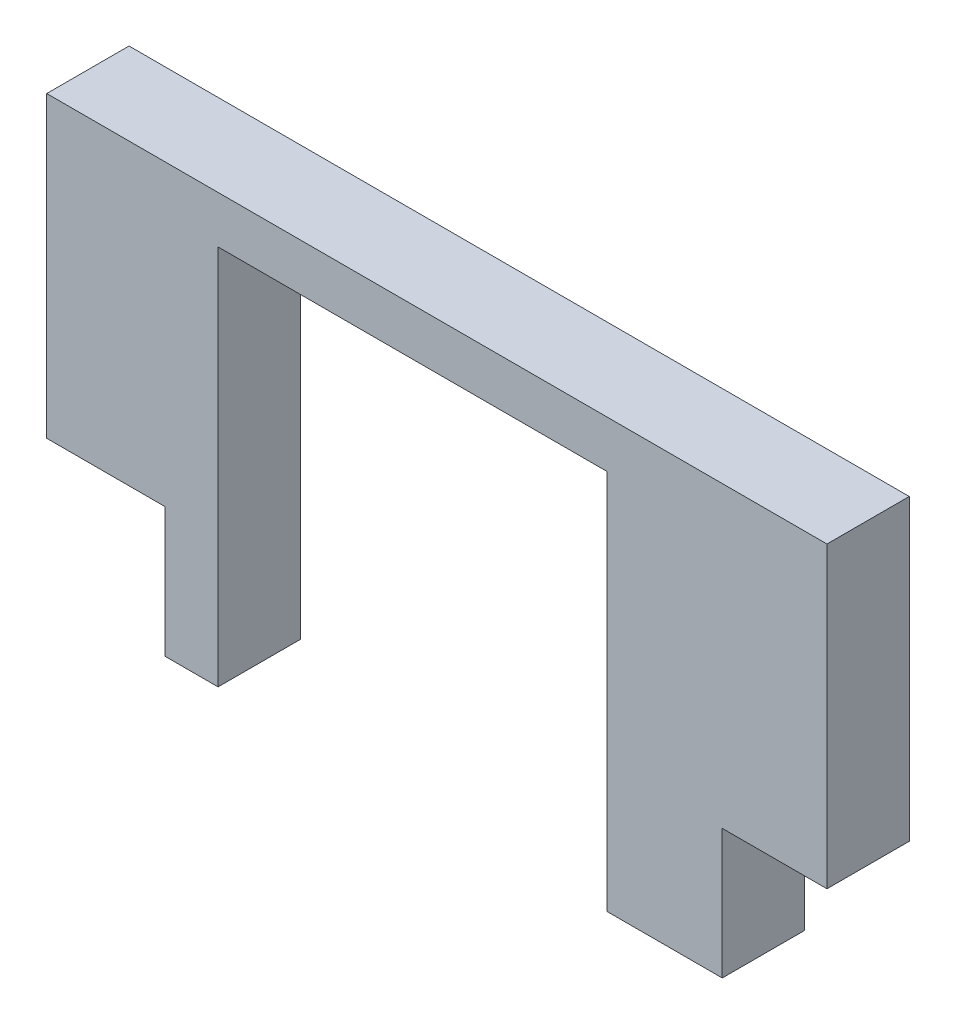
ISO-10303-21;
HEADER;
FILE_DESCRIPTION(('STEP AP214'),'2;1');
FILE_NAME('part.step','',(''),(''),'','','');
FILE_SCHEMA(('AUTOMOTIVE_DESIGN { 1 0 10303 214 1 1 1 1 }'));
ENDSEC;
DATA;
#1=APPLICATION_CONTEXT('core data for automotive mechanical design processes');
#2=APPLICATION_PROTOCOL_DEFINITION('international standard','automotive_design',2000,#1);
#3=PRODUCT_CONTEXT('',#1,'mechanical');
#4=PRODUCT('Part','Part','',(#3));
#5=PRODUCT_RELATED_PRODUCT_CATEGORY('part','',(#4));
#6=PRODUCT_DEFINITION_FORMATION('','',#4);
#7=PRODUCT_DEFINITION_CONTEXT('part definition',#1,'design');
#8=PRODUCT_DEFINITION('design','',#6,#7);
#9=PRODUCT_DEFINITION_SHAPE('','',#8);
#10=(LENGTH_UNIT() NAMED_UNIT(*) SI_UNIT(.MILLI.,.METRE.));
#11=(NAMED_UNIT(*) PLANE_ANGLE_UNIT() SI_UNIT($,.RADIAN.));
#12=(NAMED_UNIT(*) SI_UNIT($,.STERADIAN.) SOLID_ANGLE_UNIT());
#13=UNCERTAINTY_MEASURE_WITH_UNIT(LENGTH_MEASURE(1.E-05),#10,'distance_accuracy_value','');
#14=(GEOMETRIC_REPRESENTATION_CONTEXT(3) GLOBAL_UNCERTAINTY_ASSIGNED_CONTEXT((#13)) GLOBAL_UNIT_ASSIGNED_CONTEXT((#10,
#11,#12)) REPRESENTATION_CONTEXT('',''));
#15=CARTESIAN_POINT('',(0.,0.,0.));
#16=DIRECTION('',(0.,0.,1.));
#17=DIRECTION('',(1.,0.,0.));
#18=AXIS2_PLACEMENT_3D('',#15,#16,#17);
#19=CARTESIAN_POINT('',(0.,16.66,-3.175));
#20=DIRECTION('',(0.,1.,0.));
#21=DIRECTION('',(0.,0.,1.));
#22=AXIS2_PLACEMENT_3D('',#19,#20,#21);
#23=PLANE('',#22);
#24=DIRECTION('',(-1.,0.,0.));
#25=VECTOR('',#24,1.);
#26=CARTESIAN_POINT('',(0.,16.66,0.));
#27=LINE('',#26,#25);
#28=CARTESIAN_POINT('',(30.1,16.66,0.));
#29=VERTEX_POINT('',#28);
#30=CARTESIAN_POINT('',(0.,16.66,0.));
#31=VERTEX_POINT('',#30);
#32=EDGE_CURVE('E188',#29,#31,#27,.T.);
#33=ORIENTED_EDGE('',*,*,#32,.F.);
#34=DIRECTION('',(0.,0.,1.));
#35=VECTOR('',#34,1.);
#36=CARTESIAN_POINT('',(30.1,16.66,-3.175));
#37=LINE('',#36,#35);
#38=CARTESIAN_POINT('',(30.1,16.66,-3.175));
#39=VERTEX_POINT('',#38);
#40=EDGE_CURVE('E51',#39,#29,#37,.T.);
#41=ORIENTED_EDGE('',*,*,#40,.F.);
#42=DIRECTION('',(-1.,0.,0.));
#43=VECTOR('',#42,1.);
#44=CARTESIAN_POINT('',(0.,16.66,-3.175));
#45=LINE('',#44,#43);
#46=CARTESIAN_POINT('',(0.,16.66,-3.175));
#47=VERTEX_POINT('',#46);
#48=EDGE_CURVE('E150',#39,#47,#45,.T.);
#49=ORIENTED_EDGE('',*,*,#48,.T.);
#50=DIRECTION('',(0.,0.,1.));
#51=VECTOR('',#50,1.);
#52=CARTESIAN_POINT('',(0.,16.66,-3.175));
#53=LINE('',#52,#51);
#54=EDGE_CURVE('E11',#47,#31,#53,.T.);
#55=ORIENTED_EDGE('',*,*,#54,.T.);
#56=EDGE_LOOP('',(#33,#41,#49,#55));
#57=FACE_BOUND('',#56,.T.);
#58=ADVANCED_FACE('F41',(#57),#23,.T.);
#59=CARTESIAN_POINT('',(30.1,16.66,-3.175));
#60=DIRECTION('',(1.,0.,0.));
#61=DIRECTION('',(0.,0.,-1.));
#62=AXIS2_PLACEMENT_3D('',#59,#60,#61);
#63=PLANE('',#62);
#64=DIRECTION('',(0.,1.,0.));
#65=VECTOR('',#64,1.);
#66=CARTESIAN_POINT('',(30.1,16.66,0.));
#67=LINE('',#66,#65);
#68=CARTESIAN_POINT('',(30.1,5.13999999999969,0.));
#69=VERTEX_POINT('',#68);
#70=EDGE_CURVE('E135',#69,#29,#67,.T.);
#71=ORIENTED_EDGE('',*,*,#70,.F.);
#72=DIRECTION('',(0.,0.,1.));
#73=VECTOR('',#72,1.);
#74=CARTESIAN_POINT('',(30.1,5.13999999999969,-3.175));
#75=LINE('',#74,#73);
#76=CARTESIAN_POINT('',(30.1,5.13999999999969,-3.175));
#77=VERTEX_POINT('',#76);
#78=EDGE_CURVE('E131',#77,#69,#75,.T.);
#79=ORIENTED_EDGE('',*,*,#78,.F.);
#80=DIRECTION('',(0.,1.,0.));
#81=VECTOR('',#80,1.);
#82=CARTESIAN_POINT('',(30.1,6.34,-3.175));
#83=LINE('',#82,#81);
#84=EDGE_CURVE('E134',#77,#39,#83,.T.);
#85=ORIENTED_EDGE('',*,*,#84,.T.);
#86=ORIENTED_EDGE('',*,*,#40,.T.);
#87=EDGE_LOOP('',(#71,#79,#85,#86));
#88=FACE_BOUND('',#87,.T.);
#89=ADVANCED_FACE('F133',(#88),#63,.T.);
#90=CARTESIAN_POINT('',(30.1,5.13999999999969,-3.175));
#91=DIRECTION('',(0.,-1.,0.));
#92=DIRECTION('',(1.,0.,0.));
#93=AXIS2_PLACEMENT_3D('',#90,#91,#92);
#94=PLANE('',#93);
#95=DIRECTION('',(1.,0.,0.));
#96=VECTOR('',#95,1.);
#97=CARTESIAN_POINT('',(30.1,5.13999999999969,0.));
#98=LINE('',#97,#96);
#99=CARTESIAN_POINT('',(26.0600000000024,5.1399999999997,0.));
#100=VERTEX_POINT('',#99);
#101=EDGE_CURVE('E185',#100,#69,#98,.T.);
#102=ORIENTED_EDGE('',*,*,#101,.F.);
#103=DIRECTION('',(0.,0.,1.));
#104=VECTOR('',#103,1.);
#105=CARTESIAN_POINT('',(26.0600000000024,5.1399999999997,-3.175));
#106=LINE('',#105,#104);
#107=CARTESIAN_POINT('',(26.0600000000024,5.1399999999997,-3.175));
#108=VERTEX_POINT('',#107);
#109=EDGE_CURVE('E140',#108,#100,#106,.T.);
#110=ORIENTED_EDGE('',*,*,#109,.F.);
#111=DIRECTION('',(1.,0.,0.));
#112=VECTOR('',#111,1.);
#113=CARTESIAN_POINT('',(30.1,5.13999999999969,-3.175));
#114=LINE('',#113,#112);
#115=EDGE_CURVE('E147',#108,#77,#114,.T.);
#116=ORIENTED_EDGE('',*,*,#115,.T.);
#117=ORIENTED_EDGE('',*,*,#78,.T.);
#118=EDGE_LOOP('',(#102,#110,#116,#117));
#119=FACE_BOUND('',#118,.T.);
#120=ADVANCED_FACE('F152',(#119),#94,.T.);
#121=CARTESIAN_POINT('',(26.0600000000024,5.1399999999997,-3.175));
#122=DIRECTION('',(1.,0.,0.));
#123=DIRECTION('',(0.,0.,-1.));
#124=AXIS2_PLACEMENT_3D('',#121,#122,#123);
#125=PLANE('',#124);
#126=DIRECTION('',(0.,1.,0.));
#127=VECTOR('',#126,1.);
#128=CARTESIAN_POINT('',(26.0600000000024,5.1399999999997,0.));
#129=LINE('',#128,#127);
#130=CARTESIAN_POINT('',(26.0600000000024,0.139999999999705,0.));
#131=VERTEX_POINT('',#130);
#132=EDGE_CURVE('E182',#131,#100,#129,.T.);
#133=ORIENTED_EDGE('',*,*,#132,.F.);
#134=DIRECTION('',(0.,0.,1.));
#135=VECTOR('',#134,1.);
#136=CARTESIAN_POINT('',(26.0600000000024,0.139999999999705,-3.175));
#137=LINE('',#136,#135);
#138=CARTESIAN_POINT('',(26.0600000000024,0.139999999999705,-3.175));
#139=VERTEX_POINT('',#138);
#140=EDGE_CURVE('E193',#139,#131,#137,.T.);
#141=ORIENTED_EDGE('',*,*,#140,.F.);
#142=DIRECTION('',(0.,1.,0.));
#143=VECTOR('',#142,1.);
#144=CARTESIAN_POINT('',(26.0600000000024,5.1399999999997,-3.175));
#145=LINE('',#144,#143);
#146=EDGE_CURVE('E153',#139,#108,#145,.T.);
#147=ORIENTED_EDGE('',*,*,#146,.T.);
#148=ORIENTED_EDGE('',*,*,#109,.T.);
#149=EDGE_LOOP('',(#133,#141,#147,#148));
#150=FACE_BOUND('',#149,.T.);
#151=ADVANCED_FACE('F229',(#150),#125,.T.);
#152=CARTESIAN_POINT('',(26.0600000000024,0.139999999999705,-3.175));
#153=DIRECTION('',(-4.22529075218631E-13,-1.,0.));
#154=DIRECTION('',(1.,-4.22529075218631E-13,0.));
#155=AXIS2_PLACEMENT_3D('',#152,#153,#154);
#156=PLANE('',#155);
#157=DIRECTION('',(1.,-4.22529075218631E-13,0.));
#158=VECTOR('',#157,1.);
#159=CARTESIAN_POINT('',(26.0600000000024,0.139999999999705,0.));
#160=LINE('',#159,#158);
#161=CARTESIAN_POINT('',(21.61,0.139999999999576,0.));
#162=VERTEX_POINT('',#161);
#163=EDGE_CURVE('E179',#162,#131,#160,.T.);
#164=ORIENTED_EDGE('',*,*,#163,.F.);
#165=DIRECTION('',(0.,0.,1.));
#166=VECTOR('',#165,1.);
#167=CARTESIAN_POINT('',(21.61,0.139999999999576,-3.175));
#168=LINE('',#167,#166);
#169=CARTESIAN_POINT('',(21.61,0.139999999999576,-3.175));
#170=VERTEX_POINT('',#169);
#171=EDGE_CURVE('E195',#170,#162,#168,.T.);
#172=ORIENTED_EDGE('',*,*,#171,.F.);
#173=DIRECTION('',(1.,1.13450915328883E-13,0.));
#174=VECTOR('',#173,1.);
#175=CARTESIAN_POINT('',(21.61,0.139999999999576,-3.175));
#176=LINE('',#175,#174);
#177=EDGE_CURVE('E155',#170,#139,#176,.T.);
#178=ORIENTED_EDGE('',*,*,#177,.T.);
#179=ORIENTED_EDGE('',*,*,#140,.T.);
#180=EDGE_LOOP('',(#164,#172,#178,#179));
#181=FACE_BOUND('',#180,.T.);
#182=ADVANCED_FACE('F232',(#181),#156,.T.);
#183=CARTESIAN_POINT('',(21.61,5.13999999999969,-3.175));
#184=DIRECTION('',(-1.,0.,0.));
#185=DIRECTION('',(0.,-1.,0.));
#186=AXIS2_PLACEMENT_3D('',#183,#184,#185);
#187=PLANE('',#186);
#188=DIRECTION('',(0.,-1.,0.));
#189=VECTOR('',#188,1.);
#190=CARTESIAN_POINT('',(21.61,5.13999999999969,0.));
#191=LINE('',#190,#189);
#192=CARTESIAN_POINT('',(21.61,14.84,0.));
#193=VERTEX_POINT('',#192);
#194=EDGE_CURVE('E176',#193,#162,#191,.T.);
#195=ORIENTED_EDGE('',*,*,#194,.F.);
#196=DIRECTION('',(0.,0.,1.));
#197=VECTOR('',#196,1.);
#198=CARTESIAN_POINT('',(21.61,14.84,-3.175));
#199=LINE('',#198,#197);
#200=CARTESIAN_POINT('',(21.61,14.84,-3.175));
#201=VERTEX_POINT('',#200);
#202=EDGE_CURVE('E198',#201,#193,#199,.T.);
#203=ORIENTED_EDGE('',*,*,#202,.F.);
#204=DIRECTION('',(0.,-1.,0.));
#205=VECTOR('',#204,1.);
#206=CARTESIAN_POINT('',(21.61,14.84,-3.175));
#207=LINE('',#206,#205);
#208=EDGE_CURVE('E405',#201,#170,#207,.T.);
#209=ORIENTED_EDGE('',*,*,#208,.T.);
#210=ORIENTED_EDGE('',*,*,#171,.T.);
#211=EDGE_LOOP('',(#195,#203,#209,#210));
#212=FACE_BOUND('',#211,.T.);
#213=ADVANCED_FACE('F236',(#212),#187,.T.);
#214=CARTESIAN_POINT('',(6.61,14.84,-3.175));
#215=DIRECTION('',(0.,-1.,0.));
#216=DIRECTION('',(0.,0.,-1.));
#217=AXIS2_PLACEMENT_3D('',#214,#215,#216);
#218=PLANE('',#217);
#219=DIRECTION('',(1.,0.,0.));
#220=VECTOR('',#219,1.);
#221=CARTESIAN_POINT('',(6.61,14.84,0.));
#222=LINE('',#221,#220);
#223=CARTESIAN_POINT('',(6.61,14.84,0.));
#224=VERTEX_POINT('',#223);
#225=EDGE_CURVE('E173',#224,#193,#222,.T.);
#226=ORIENTED_EDGE('',*,*,#225,.F.);
#227=DIRECTION('',(0.,0.,1.));
#228=VECTOR('',#227,1.);
#229=CARTESIAN_POINT('',(6.61,14.84,-3.175));
#230=LINE('',#229,#228);
#231=CARTESIAN_POINT('',(6.61,14.84,-3.175));
#232=VERTEX_POINT('',#231);
#233=EDGE_CURVE('E201',#232,#224,#230,.T.);
#234=ORIENTED_EDGE('',*,*,#233,.F.);
#235=DIRECTION('',(1.,0.,0.));
#236=VECTOR('',#235,1.);
#237=CARTESIAN_POINT('',(6.61,14.84,-3.175));
#238=LINE('',#237,#236);
#239=EDGE_CURVE('E403',#232,#201,#238,.T.);
#240=ORIENTED_EDGE('',*,*,#239,.T.);
#241=ORIENTED_EDGE('',*,*,#202,.T.);
#242=EDGE_LOOP('',(#226,#234,#240,#241));
#243=FACE_BOUND('',#242,.T.);
#244=ADVANCED_FACE('F240',(#243),#218,.T.);
#245=CARTESIAN_POINT('',(6.61,6.34,-3.175));
#246=DIRECTION('',(1.,0.,0.));
#247=DIRECTION('',(0.,1.,0.));
#248=AXIS2_PLACEMENT_3D('',#245,#246,#247);
#249=PLANE('',#248);
#250=DIRECTION('',(0.,1.,0.));
#251=VECTOR('',#250,1.);
#252=CARTESIAN_POINT('',(6.61,6.34,0.));
#253=LINE('',#252,#251);
#254=CARTESIAN_POINT('',(6.61000000000001,0.139999999999574,0.));
#255=VERTEX_POINT('',#254);
#256=EDGE_CURVE('E170',#255,#224,#253,.T.);
#257=ORIENTED_EDGE('',*,*,#256,.F.);
#258=DIRECTION('',(0.,0.,1.));
#259=VECTOR('',#258,1.);
#260=CARTESIAN_POINT('',(6.61000000000001,0.139999999999574,-3.175));
#261=LINE('',#260,#259);
#262=CARTESIAN_POINT('',(6.61000000000001,0.139999999999574,-3.175));
#263=VERTEX_POINT('',#262);
#264=EDGE_CURVE('E203',#263,#255,#261,.T.);
#265=ORIENTED_EDGE('',*,*,#264,.F.);
#266=DIRECTION('',(0.,1.,0.));
#267=VECTOR('',#266,1.);
#268=CARTESIAN_POINT('',(6.61000000000001,0.139999999999574,-3.175));
#269=LINE('',#268,#267);
#270=EDGE_CURVE('E398',#263,#232,#269,.T.);
#271=ORIENTED_EDGE('',*,*,#270,.T.);
#272=ORIENTED_EDGE('',*,*,#233,.T.);
#273=EDGE_LOOP('',(#257,#265,#271,#272));
#274=FACE_BOUND('',#273,.T.);
#275=ADVANCED_FACE('F244',(#274),#249,.T.);
#276=CARTESIAN_POINT('',(4.55999997600216,0.139999999999574,-3.175));
#277=DIRECTION('',(0.,-1.,0.));
#278=DIRECTION('',(0.,0.,-1.));
#279=AXIS2_PLACEMENT_3D('',#276,#277,#278);
#280=PLANE('',#279);
#281=DIRECTION('',(1.,0.,0.));
#282=VECTOR('',#281,1.);
#283=CARTESIAN_POINT('',(4.55999997600216,0.139999999999574,0.));
#284=LINE('',#283,#282);
#285=CARTESIAN_POINT('',(4.55999997600216,0.139999999999574,0.));
#286=VERTEX_POINT('',#285);
#287=EDGE_CURVE('E167',#286,#255,#284,.T.);
#288=ORIENTED_EDGE('',*,*,#287,.F.);
#289=DIRECTION('',(0.,0.,1.));
#290=VECTOR('',#289,1.);
#291=CARTESIAN_POINT('',(4.55999997600216,0.139999999999574,-3.175));
#292=LINE('',#291,#290);
#293=CARTESIAN_POINT('',(4.55999997600216,0.139999999999574,-3.175));
#294=VERTEX_POINT('',#293);
#295=EDGE_CURVE('E206',#294,#286,#292,.T.);
#296=ORIENTED_EDGE('',*,*,#295,.F.);
#297=DIRECTION('',(1.,0.,0.));
#298=VECTOR('',#297,1.);
#299=CARTESIAN_POINT('',(4.55999997600216,0.139999999999574,-3.175));
#300=LINE('',#299,#298);
#301=EDGE_CURVE('E396',#294,#263,#300,.T.);
#302=ORIENTED_EDGE('',*,*,#301,.T.);
#303=ORIENTED_EDGE('',*,*,#264,.T.);
#304=EDGE_LOOP('',(#288,#296,#302,#303));
#305=FACE_BOUND('',#304,.T.);
#306=ADVANCED_FACE('F248',(#305),#280,.T.);
#307=CARTESIAN_POINT('',(4.55999997600225,5.13999999999957,-3.175));
#308=DIRECTION('',(-1.,0.,0.));
#309=DIRECTION('',(0.,-1.,0.));
#310=AXIS2_PLACEMENT_3D('',#307,#308,#309);
#311=PLANE('',#310);
#312=DIRECTION('',(0.,-1.,0.));
#313=VECTOR('',#312,1.);
#314=CARTESIAN_POINT('',(4.55999997600225,5.13999999999957,0.));
#315=LINE('',#314,#313);
#316=CARTESIAN_POINT('',(4.55999997600225,5.13999999999957,0.));
#317=VERTEX_POINT('',#316);
#318=EDGE_CURVE('E164',#317,#286,#315,.T.);
#319=ORIENTED_EDGE('',*,*,#318,.F.);
#320=DIRECTION('',(0.,0.,1.));
#321=VECTOR('',#320,1.);
#322=CARTESIAN_POINT('',(4.55999997600225,5.13999999999957,-3.175));
#323=LINE('',#322,#321);
#324=CARTESIAN_POINT('',(4.55999997600225,5.13999999999957,-3.175));
#325=VERTEX_POINT('',#324);
#326=EDGE_CURVE('E207',#325,#317,#323,.T.);
#327=ORIENTED_EDGE('',*,*,#326,.F.);
#328=DIRECTION('',(0.,-1.,0.));
#329=VECTOR('',#328,1.);
#330=CARTESIAN_POINT('',(4.55999997600225,5.13999999999957,-3.175));
#331=LINE('',#330,#329);
#332=EDGE_CURVE('E407',#325,#294,#331,.T.);
#333=ORIENTED_EDGE('',*,*,#332,.T.);
#334=ORIENTED_EDGE('',*,*,#295,.T.);
#335=EDGE_LOOP('',(#319,#327,#333,#334));
#336=FACE_BOUND('',#335,.T.);
#337=ADVANCED_FACE('F252',(#336),#311,.T.);
#338=CARTESIAN_POINT('',(0.,5.14,-3.175));
#339=DIRECTION('',(0.,-1.,0.));
#340=DIRECTION('',(1.,0.,0.));
#341=AXIS2_PLACEMENT_3D('',#338,#339,#340);
#342=PLANE('',#341);
#343=DIRECTION('',(1.,0.,0.));
#344=VECTOR('',#343,1.);
#345=CARTESIAN_POINT('',(0.,5.14,0.));
#346=LINE('',#345,#344);
#347=CARTESIAN_POINT('',(0.,5.14,0.));
#348=VERTEX_POINT('',#347);
#349=EDGE_CURVE('E161',#348,#317,#346,.T.);
#350=ORIENTED_EDGE('',*,*,#349,.F.);
#351=DIRECTION('',(0.,0.,1.));
#352=VECTOR('',#351,1.);
#353=CARTESIAN_POINT('',(0.,5.14,-3.175));
#354=LINE('',#353,#352);
#355=CARTESIAN_POINT('',(0.,5.14,-3.175));
#356=VERTEX_POINT('',#355);
#357=EDGE_CURVE('E45',#356,#348,#354,.T.);
#358=ORIENTED_EDGE('',*,*,#357,.F.);
#359=DIRECTION('',(1.,0.,0.));
#360=VECTOR('',#359,1.);
#361=CARTESIAN_POINT('',(0.,5.14,-3.175));
#362=LINE('',#361,#360);
#363=EDGE_CURVE('E417',#356,#325,#362,.T.);
#364=ORIENTED_EDGE('',*,*,#363,.T.);
#365=ORIENTED_EDGE('',*,*,#326,.T.);
#366=EDGE_LOOP('',(#350,#358,#364,#365));
#367=FACE_BOUND('',#366,.T.);
#368=ADVANCED_FACE('F213',(#367),#342,.T.);
#369=CARTESIAN_POINT('',(0.,6.34,-3.175));
#370=DIRECTION('',(-1.,0.,0.));
#371=DIRECTION('',(0.,0.,1.));
#372=AXIS2_PLACEMENT_3D('',#369,#370,#371);
#373=PLANE('',#372);
#374=DIRECTION('',(0.,-1.,0.));
#375=VECTOR('',#374,1.);
#376=CARTESIAN_POINT('',(0.,6.34,0.));
#377=LINE('',#376,#375);
#378=EDGE_CURVE('E101',#31,#348,#377,.T.);
#379=ORIENTED_EDGE('',*,*,#378,.F.);
#380=ORIENTED_EDGE('',*,*,#54,.F.);
#381=DIRECTION('',(0.,-1.,0.));
#382=VECTOR('',#381,1.);
#383=CARTESIAN_POINT('',(0.,16.66,-3.175));
#384=LINE('',#383,#382);
#385=EDGE_CURVE('E104',#47,#356,#384,.T.);
#386=ORIENTED_EDGE('',*,*,#385,.T.);
#387=ORIENTED_EDGE('',*,*,#357,.T.);
#388=EDGE_LOOP('',(#379,#380,#386,#387));
#389=FACE_BOUND('',#388,.T.);
#390=ADVANCED_FACE('F43',(#389),#373,.T.);
#391=CARTESIAN_POINT('',(0.,0.,-3.175));
#392=DIRECTION('',(0.,0.,1.));
#393=DIRECTION('',(1.,0.,0.));
#394=AXIS2_PLACEMENT_3D('',#391,#392,#393);
#395=PLANE('',#394);
#396=ORIENTED_EDGE('',*,*,#385,.F.);
#397=ORIENTED_EDGE('',*,*,#48,.F.);
#398=ORIENTED_EDGE('',*,*,#84,.F.);
#399=ORIENTED_EDGE('',*,*,#115,.F.);
#400=ORIENTED_EDGE('',*,*,#146,.F.);
#401=ORIENTED_EDGE('',*,*,#177,.F.);
#402=ORIENTED_EDGE('',*,*,#208,.F.);
#403=ORIENTED_EDGE('',*,*,#239,.F.);
#404=ORIENTED_EDGE('',*,*,#270,.F.);
#405=ORIENTED_EDGE('',*,*,#301,.F.);
#406=ORIENTED_EDGE('',*,*,#332,.F.);
#407=ORIENTED_EDGE('',*,*,#363,.F.);
#408=EDGE_LOOP('',(#396,#397,#398,#399,#400,#401,#402,#403,#404,#405,#406,#407));
#409=FACE_BOUND('',#408,.T.);
#410=ADVANCED_FACE('F145',(#409),#395,.F.);
#411=CARTESIAN_POINT('',(0.,0.,0.));
#412=DIRECTION('',(0.,0.,1.));
#413=DIRECTION('',(1.,0.,0.));
#414=AXIS2_PLACEMENT_3D('',#411,#412,#413);
#415=PLANE('',#414);
#416=ORIENTED_EDGE('',*,*,#32,.T.);
#417=ORIENTED_EDGE('',*,*,#378,.T.);
#418=ORIENTED_EDGE('',*,*,#349,.T.);
#419=ORIENTED_EDGE('',*,*,#318,.T.);
#420=ORIENTED_EDGE('',*,*,#287,.T.);
#421=ORIENTED_EDGE('',*,*,#256,.T.);
#422=ORIENTED_EDGE('',*,*,#225,.T.);
#423=ORIENTED_EDGE('',*,*,#194,.T.);
#424=ORIENTED_EDGE('',*,*,#163,.T.);
#425=ORIENTED_EDGE('',*,*,#132,.T.);
#426=ORIENTED_EDGE('',*,*,#101,.T.);
#427=ORIENTED_EDGE('',*,*,#70,.T.);
#428=EDGE_LOOP('',(#416,#417,#418,#419,#420,#421,#422,#423,#424,#425,#426,#427));
#429=FACE_BOUND('',#428,.T.);
#430=ADVANCED_FACE('F215',(#429),#415,.T.);
#431=CLOSED_SHELL('',(#58,#89,#120,#151,#182,#213,#244,#275,#306,#337,#368,#390,#410,#430));
#432=MANIFOLD_SOLID_BREP('B2',#431);
#433=ADVANCED_BREP_SHAPE_REPRESENTATION('',(#18,#432),#14);
#434=SHAPE_DEFINITION_REPRESENTATION(#9,#433);
ENDSEC;
END-ISO-10303-21;
